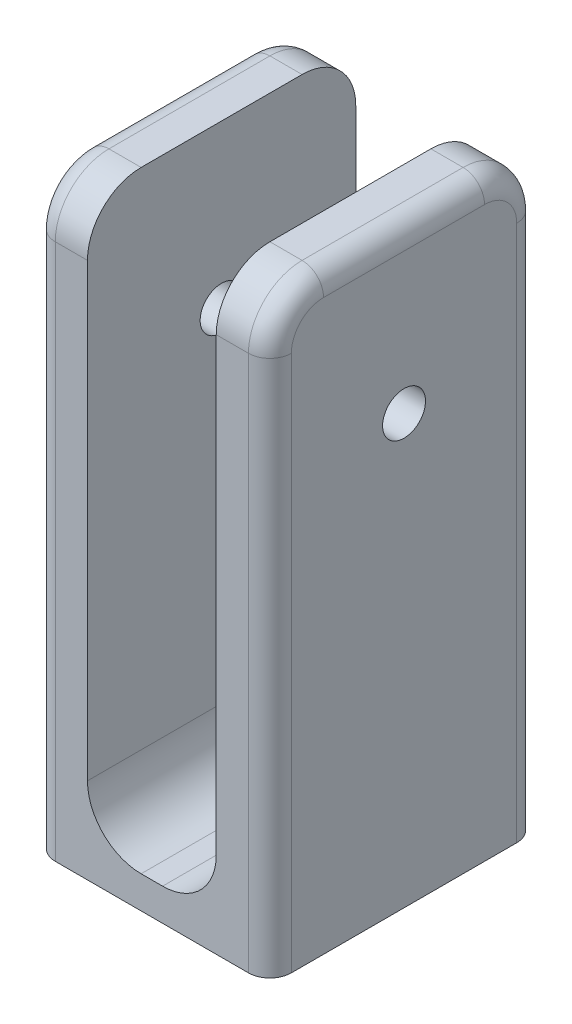
ISO-10303-21;
HEADER;
FILE_DESCRIPTION(('STEP AP214'),'2;1');
FILE_NAME('part.step','',(''),(''),'','','');
FILE_SCHEMA(('AUTOMOTIVE_DESIGN { 1 0 10303 214 1 1 1 1 }'));
ENDSEC;
DATA;
#1=APPLICATION_CONTEXT('core data for automotive mechanical design processes');
#2=APPLICATION_PROTOCOL_DEFINITION('international standard','automotive_design',2000,#1);
#3=PRODUCT_CONTEXT('',#1,'mechanical');
#4=PRODUCT('Part','Part','',(#3));
#5=PRODUCT_RELATED_PRODUCT_CATEGORY('part','',(#4));
#6=PRODUCT_DEFINITION_FORMATION('','',#4);
#7=PRODUCT_DEFINITION_CONTEXT('part definition',#1,'design');
#8=PRODUCT_DEFINITION('design','',#6,#7);
#9=PRODUCT_DEFINITION_SHAPE('','',#8);
#10=(LENGTH_UNIT() NAMED_UNIT(*) SI_UNIT(.MILLI.,.METRE.));
#11=(NAMED_UNIT(*) PLANE_ANGLE_UNIT() SI_UNIT($,.RADIAN.));
#12=(NAMED_UNIT(*) SI_UNIT($,.STERADIAN.) SOLID_ANGLE_UNIT());
#13=UNCERTAINTY_MEASURE_WITH_UNIT(LENGTH_MEASURE(1.E-05),#10,'distance_accuracy_value','');
#14=(GEOMETRIC_REPRESENTATION_CONTEXT(3) GLOBAL_UNCERTAINTY_ASSIGNED_CONTEXT((#13)) GLOBAL_UNIT_ASSIGNED_CONTEXT((#10,
#11,#12)) REPRESENTATION_CONTEXT('',''));
#15=CARTESIAN_POINT('',(0.,0.,0.));
#16=DIRECTION('',(0.,0.,1.));
#17=DIRECTION('',(1.,0.,0.));
#18=AXIS2_PLACEMENT_3D('',#15,#16,#17);
#19=CARTESIAN_POINT('',(0.,3.,-12.5));
#20=DIRECTION('',(0.,0.,1.));
#21=DIRECTION('',(1.,0.,0.));
#22=AXIS2_PLACEMENT_3D('',#19,#20,#21);
#23=PLANE('',#22);
#24=DIRECTION('',(-1.,0.,0.));
#25=VECTOR('',#24,1.);
#26=CARTESIAN_POINT('',(0.,0.,-12.5));
#27=LINE('',#26,#25);
#28=CARTESIAN_POINT('',(9.,0.,-12.5));
#29=VERTEX_POINT('',#28);
#30=CARTESIAN_POINT('',(-9.,0.,-12.5));
#31=VERTEX_POINT('',#30);
#32=EDGE_CURVE('E226',#29,#31,#27,.T.);
#33=ORIENTED_EDGE('',*,*,#32,.T.);
#34=DIRECTION('',(0.,-1.,0.));
#35=VECTOR('',#34,1.);
#36=CARTESIAN_POINT('',(-9.,3.,-12.5));
#37=LINE('',#36,#35);
#38=CARTESIAN_POINT('',(-9.,50.,-12.5));
#39=VERTEX_POINT('',#38);
#40=EDGE_CURVE('E295',#31,#39,#37,.F.);
#41=ORIENTED_EDGE('',*,*,#40,.T.);
#42=DIRECTION('',(-1.,0.,0.));
#43=VECTOR('',#42,1.);
#44=CARTESIAN_POINT('',(-6.,50.,-12.5));
#45=LINE('',#44,#43);
#46=CARTESIAN_POINT('',(-6.,50.,-12.5));
#47=VERTEX_POINT('',#46);
#48=EDGE_CURVE('E194',#39,#47,#45,.F.);
#49=ORIENTED_EDGE('',*,*,#48,.T.);
#50=DIRECTION('',(0.,-1.,0.));
#51=VECTOR('',#50,1.);
#52=CARTESIAN_POINT('',(-6.,55.,-12.5));
#53=LINE('',#52,#51);
#54=CARTESIAN_POINT('',(-6.,8.,-12.5));
#55=VERTEX_POINT('',#54);
#56=EDGE_CURVE('E223',#47,#55,#53,.T.);
#57=ORIENTED_EDGE('',*,*,#56,.T.);
#58=CARTESIAN_POINT('',(-1.,8.,-12.5));
#59=DIRECTION('',(0.,0.,1.));
#60=DIRECTION('',(1.,0.,0.));
#61=AXIS2_PLACEMENT_3D('',#58,#59,#60);
#62=CIRCLE('',#61,5.);
#63=CARTESIAN_POINT('',(-1.,3.,-12.5));
#64=VERTEX_POINT('',#63);
#65=EDGE_CURVE('E271',#55,#64,#62,.T.);
#66=ORIENTED_EDGE('',*,*,#65,.T.);
#67=DIRECTION('',(-1.,0.,0.));
#68=VECTOR('',#67,1.);
#69=CARTESIAN_POINT('',(0.,3.,-12.5));
#70=LINE('',#69,#68);
#71=CARTESIAN_POINT('',(0.999999999999997,3.,-12.5));
#72=VERTEX_POINT('',#71);
#73=EDGE_CURVE('E227',#72,#64,#70,.T.);
#74=ORIENTED_EDGE('',*,*,#73,.F.);
#75=CARTESIAN_POINT('',(0.999999999999997,8.,-12.5));
#76=DIRECTION('',(0.,0.,1.));
#77=DIRECTION('',(1.,0.,0.));
#78=AXIS2_PLACEMENT_3D('',#75,#76,#77);
#79=CIRCLE('',#78,5.);
#80=CARTESIAN_POINT('',(6.,8.,-12.5));
#81=VERTEX_POINT('',#80);
#82=EDGE_CURVE('E267',#72,#81,#79,.T.);
#83=ORIENTED_EDGE('',*,*,#82,.T.);
#84=DIRECTION('',(0.,-1.,0.));
#85=VECTOR('',#84,1.);
#86=CARTESIAN_POINT('',(6.,55.,-12.5));
#87=LINE('',#86,#85);
#88=CARTESIAN_POINT('',(6.,50.,-12.5));
#89=VERTEX_POINT('',#88);
#90=EDGE_CURVE('E204',#89,#81,#87,.T.);
#91=ORIENTED_EDGE('',*,*,#90,.F.);
#92=DIRECTION('',(-1.,0.,0.));
#93=VECTOR('',#92,1.);
#94=CARTESIAN_POINT('',(11.,50.,-12.5));
#95=LINE('',#94,#93);
#96=CARTESIAN_POINT('',(9.,50.,-12.5));
#97=VERTEX_POINT('',#96);
#98=EDGE_CURVE('E190',#89,#97,#95,.F.);
#99=ORIENTED_EDGE('',*,*,#98,.T.);
#100=DIRECTION('',(0.,-1.,0.));
#101=VECTOR('',#100,1.);
#102=CARTESIAN_POINT('',(9.,0.,-12.5));
#103=LINE('',#102,#101);
#104=EDGE_CURVE('E292',#97,#29,#103,.T.);
#105=ORIENTED_EDGE('',*,*,#104,.T.);
#106=EDGE_LOOP('',(#33,#41,#49,#57,#66,#74,#83,#91,#99,#105));
#107=FACE_BOUND('',#106,.T.);
#108=ADVANCED_FACE('F35',(#107),#23,.F.);
#109=CARTESIAN_POINT('',(0.,3.,12.5));
#110=DIRECTION('',(0.,0.,1.));
#111=DIRECTION('',(1.,0.,0.));
#112=AXIS2_PLACEMENT_3D('',#109,#110,#111);
#113=PLANE('',#112);
#114=DIRECTION('',(-1.,0.,0.));
#115=VECTOR('',#114,1.);
#116=CARTESIAN_POINT('',(0.,50.,12.5));
#117=LINE('',#116,#115);
#118=CARTESIAN_POINT('',(-6.,50.,12.5));
#119=VERTEX_POINT('',#118);
#120=CARTESIAN_POINT('',(-9.,50.,12.5));
#121=VERTEX_POINT('',#120);
#122=EDGE_CURVE('E257',#119,#121,#117,.T.);
#123=ORIENTED_EDGE('',*,*,#122,.T.);
#124=DIRECTION('',(0.,-1.,0.));
#125=VECTOR('',#124,1.);
#126=CARTESIAN_POINT('',(-9.,0.,12.5));
#127=LINE('',#126,#125);
#128=CARTESIAN_POINT('',(-9.,0.,12.5));
#129=VERTEX_POINT('',#128);
#130=EDGE_CURVE('E11',#121,#129,#127,.T.);
#131=ORIENTED_EDGE('',*,*,#130,.T.);
#132=DIRECTION('',(-1.,0.,0.));
#133=VECTOR('',#132,1.);
#134=CARTESIAN_POINT('',(0.,0.,12.5));
#135=LINE('',#134,#133);
#136=CARTESIAN_POINT('',(9.00000000000001,0.,12.5));
#137=VERTEX_POINT('',#136);
#138=EDGE_CURVE('E231',#137,#129,#135,.T.);
#139=ORIENTED_EDGE('',*,*,#138,.F.);
#140=DIRECTION('',(0.,-1.,0.));
#141=VECTOR('',#140,1.);
#142=CARTESIAN_POINT('',(9.00000000000001,3.,12.5));
#143=LINE('',#142,#141);
#144=CARTESIAN_POINT('',(9.00000000000001,50.,12.5));
#145=VERTEX_POINT('',#144);
#146=EDGE_CURVE('E44',#137,#145,#143,.F.);
#147=ORIENTED_EDGE('',*,*,#146,.T.);
#148=DIRECTION('',(-1.,0.,0.));
#149=VECTOR('',#148,1.);
#150=CARTESIAN_POINT('',(0.,50.,12.5));
#151=LINE('',#150,#149);
#152=CARTESIAN_POINT('',(6.,50.,12.5));
#153=VERTEX_POINT('',#152);
#154=EDGE_CURVE('E255',#145,#153,#151,.T.);
#155=ORIENTED_EDGE('',*,*,#154,.T.);
#156=DIRECTION('',(0.,-1.,0.));
#157=VECTOR('',#156,1.);
#158=CARTESIAN_POINT('',(6.,55.,12.5));
#159=LINE('',#158,#157);
#160=CARTESIAN_POINT('',(6.,8.,12.5));
#161=VERTEX_POINT('',#160);
#162=EDGE_CURVE('E200',#153,#161,#159,.T.);
#163=ORIENTED_EDGE('',*,*,#162,.T.);
#164=CARTESIAN_POINT('',(1.,8.,12.5));
#165=DIRECTION('',(0.,0.,1.));
#166=DIRECTION('',(1.,0.,0.));
#167=AXIS2_PLACEMENT_3D('',#164,#165,#166);
#168=CIRCLE('',#167,5.);
#169=CARTESIAN_POINT('',(1.,3.,12.5));
#170=VERTEX_POINT('',#169);
#171=EDGE_CURVE('E265',#161,#170,#168,.F.);
#172=ORIENTED_EDGE('',*,*,#171,.T.);
#173=DIRECTION('',(-1.,0.,0.));
#174=VECTOR('',#173,1.);
#175=CARTESIAN_POINT('',(0.,3.,12.5));
#176=LINE('',#175,#174);
#177=CARTESIAN_POINT('',(-0.999999999999997,3.,12.5));
#178=VERTEX_POINT('',#177);
#179=EDGE_CURVE('E230',#170,#178,#176,.T.);
#180=ORIENTED_EDGE('',*,*,#179,.T.);
#181=CARTESIAN_POINT('',(-0.999999999999997,8.,12.5));
#182=DIRECTION('',(0.,0.,1.));
#183=DIRECTION('',(1.,0.,0.));
#184=AXIS2_PLACEMENT_3D('',#181,#182,#183);
#185=CIRCLE('',#184,5.);
#186=CARTESIAN_POINT('',(-6.,8.,12.5));
#187=VERTEX_POINT('',#186);
#188=EDGE_CURVE('E269',#178,#187,#185,.F.);
#189=ORIENTED_EDGE('',*,*,#188,.T.);
#190=DIRECTION('',(0.,-1.,0.));
#191=VECTOR('',#190,1.);
#192=CARTESIAN_POINT('',(-6.,55.,12.5));
#193=LINE('',#192,#191);
#194=EDGE_CURVE('E218',#119,#187,#193,.T.);
#195=ORIENTED_EDGE('',*,*,#194,.F.);
#196=EDGE_LOOP('',(#123,#131,#139,#147,#155,#163,#172,#180,#189,#195));
#197=FACE_BOUND('',#196,.T.);
#198=ADVANCED_FACE('F374',(#197),#113,.T.);
#199=CARTESIAN_POINT('',(0.,3.,0.));
#200=DIRECTION('',(0.,1.,0.));
#201=DIRECTION('',(0.,0.,1.));
#202=AXIS2_PLACEMENT_3D('',#199,#200,#201);
#203=PLANE('',#202);
#204=ORIENTED_EDGE('',*,*,#179,.F.);
#205=DIRECTION('',(0.,0.,1.));
#206=VECTOR('',#205,1.);
#207=CARTESIAN_POINT('',(0.999999999999999,3.,0.));
#208=LINE('',#207,#206);
#209=EDGE_CURVE('E263',#170,#72,#208,.F.);
#210=ORIENTED_EDGE('',*,*,#209,.T.);
#211=ORIENTED_EDGE('',*,*,#73,.T.);
#212=DIRECTION('',(0.,0.,1.));
#213=VECTOR('',#212,1.);
#214=CARTESIAN_POINT('',(-0.999999999999997,3.,12.5));
#215=LINE('',#214,#213);
#216=EDGE_CURVE('E260',#64,#178,#215,.T.);
#217=ORIENTED_EDGE('',*,*,#216,.T.);
#218=EDGE_LOOP('',(#204,#210,#211,#217));
#219=FACE_BOUND('',#218,.T.);
#220=ADVANCED_FACE('F379',(#219),#203,.T.);
#221=CARTESIAN_POINT('',(0.,0.,0.));
#222=DIRECTION('',(0.,1.,0.));
#223=DIRECTION('',(0.,0.,1.));
#224=AXIS2_PLACEMENT_3D('',#221,#222,#223);
#225=PLANE('',#224);
#226=DIRECTION('',(0.,0.,1.));
#227=VECTOR('',#226,1.);
#228=CARTESIAN_POINT('',(-11.,0.,0.));
#229=LINE('',#228,#227);
#230=CARTESIAN_POINT('',(-11.,0.,-10.5));
#231=VERTEX_POINT('',#230);
#232=CARTESIAN_POINT('',(-11.,0.,10.5));
#233=VERTEX_POINT('',#232);
#234=EDGE_CURVE('E214',#231,#233,#229,.T.);
#235=ORIENTED_EDGE('',*,*,#234,.F.);
#236=CARTESIAN_POINT('',(-9.,0.,-10.5));
#237=DIRECTION('',(0.,1.,0.));
#238=DIRECTION('',(0.,0.,1.));
#239=AXIS2_PLACEMENT_3D('',#236,#237,#238);
#240=CIRCLE('',#239,2.);
#241=EDGE_CURVE('E290',#231,#31,#240,.F.);
#242=ORIENTED_EDGE('',*,*,#241,.T.);
#243=ORIENTED_EDGE('',*,*,#32,.F.);
#244=CARTESIAN_POINT('',(9.,0.,-10.5));
#245=DIRECTION('',(0.,1.,0.));
#246=DIRECTION('',(0.,0.,1.));
#247=AXIS2_PLACEMENT_3D('',#244,#245,#246);
#248=CIRCLE('',#247,2.);
#249=CARTESIAN_POINT('',(11.,0.,-10.5));
#250=VERTEX_POINT('',#249);
#251=EDGE_CURVE('E288',#29,#250,#248,.F.);
#252=ORIENTED_EDGE('',*,*,#251,.T.);
#253=DIRECTION('',(0.,0.,1.));
#254=VECTOR('',#253,1.);
#255=CARTESIAN_POINT('',(11.,0.,0.));
#256=LINE('',#255,#254);
#257=CARTESIAN_POINT('',(11.,0.,10.5));
#258=VERTEX_POINT('',#257);
#259=EDGE_CURVE('E201',#250,#258,#256,.T.);
#260=ORIENTED_EDGE('',*,*,#259,.T.);
#261=CARTESIAN_POINT('',(9.00000000000001,0.,10.5));
#262=DIRECTION('',(0.,1.,0.));
#263=DIRECTION('',(0.,0.,1.));
#264=AXIS2_PLACEMENT_3D('',#261,#262,#263);
#265=CIRCLE('',#264,2.);
#266=EDGE_CURVE('E284',#258,#137,#265,.F.);
#267=ORIENTED_EDGE('',*,*,#266,.T.);
#268=ORIENTED_EDGE('',*,*,#138,.T.);
#269=CARTESIAN_POINT('',(-9.,0.,10.5));
#270=DIRECTION('',(0.,1.,0.));
#271=DIRECTION('',(0.,0.,1.));
#272=AXIS2_PLACEMENT_3D('',#269,#270,#271);
#273=CIRCLE('',#272,2.);
#274=EDGE_CURVE('E286',#129,#233,#273,.F.);
#275=ORIENTED_EDGE('',*,*,#274,.T.);
#276=EDGE_LOOP('',(#235,#242,#243,#252,#260,#267,#268,#275));
#277=FACE_BOUND('',#276,.T.);
#278=ADVANCED_FACE('F353',(#277),#225,.F.);
#279=CARTESIAN_POINT('',(-6.,55.,0.));
#280=DIRECTION('',(1.,0.,0.));
#281=DIRECTION('',(0.,0.,-1.));
#282=AXIS2_PLACEMENT_3D('',#279,#280,#281);
#283=PLANE('',#282);
#284=CARTESIAN_POINT('',(-6.,39.9011310873557,0.));
#285=DIRECTION('',(1.,0.,0.));
#286=DIRECTION('',(0.,0.,-1.));
#287=AXIS2_PLACEMENT_3D('',#284,#285,#286);
#288=CIRCLE('',#287,1.99999999999999);
#289=CARTESIAN_POINT('',(-6.,39.9011310873557,-1.99999999999999));
#290=VERTEX_POINT('',#289);
#291=EDGE_CURVE('E702',#290,#290,#288,.T.);
#292=ORIENTED_EDGE('',*,*,#291,.F.);
#293=EDGE_LOOP('',(#292));
#294=FACE_BOUND('',#293,.T.);
#295=ORIENTED_EDGE('',*,*,#56,.F.);
#296=CARTESIAN_POINT('',(-6.,50.,-7.5));
#297=DIRECTION('',(1.,0.,0.));
#298=DIRECTION('',(0.,0.,-1.));
#299=AXIS2_PLACEMENT_3D('',#296,#297,#298);
#300=CIRCLE('',#299,5.);
#301=CARTESIAN_POINT('',(-6.,55.,-7.5));
#302=VERTEX_POINT('',#301);
#303=EDGE_CURVE('E253',#47,#302,#300,.T.);
#304=ORIENTED_EDGE('',*,*,#303,.T.);
#305=DIRECTION('',(0.,0.,1.));
#306=VECTOR('',#305,1.);
#307=CARTESIAN_POINT('',(-6.,55.,0.));
#308=LINE('',#307,#306);
#309=CARTESIAN_POINT('',(-6.,55.,7.5));
#310=VERTEX_POINT('',#309);
#311=EDGE_CURVE('E215',#302,#310,#308,.T.);
#312=ORIENTED_EDGE('',*,*,#311,.T.);
#313=CARTESIAN_POINT('',(-6.,50.,7.5));
#314=DIRECTION('',(1.,0.,0.));
#315=DIRECTION('',(0.,0.,-1.));
#316=AXIS2_PLACEMENT_3D('',#313,#314,#315);
#317=CIRCLE('',#316,5.);
#318=EDGE_CURVE('E251',#310,#119,#317,.T.);
#319=ORIENTED_EDGE('',*,*,#318,.T.);
#320=ORIENTED_EDGE('',*,*,#194,.T.);
#321=DIRECTION('',(0.,0.,1.));
#322=VECTOR('',#321,1.);
#323=CARTESIAN_POINT('',(-6.,8.,-12.5));
#324=LINE('',#323,#322);
#325=EDGE_CURVE('E249',#187,#55,#324,.F.);
#326=ORIENTED_EDGE('',*,*,#325,.T.);
#327=EDGE_LOOP('',(#295,#304,#312,#319,#320,#326));
#328=FACE_BOUND('',#327,.T.);
#329=ADVANCED_FACE('F454',(#294,#328),#283,.T.);
#330=CARTESIAN_POINT('',(-11.,55.,0.));
#331=DIRECTION('',(1.,0.,0.));
#332=DIRECTION('',(0.,0.,-1.));
#333=AXIS2_PLACEMENT_3D('',#330,#331,#332);
#334=PLANE('',#333);
#335=CARTESIAN_POINT('',(-11.,39.9011310873557,0.));
#336=DIRECTION('',(-1.,0.,0.));
#337=DIRECTION('',(0.,0.,1.));
#338=AXIS2_PLACEMENT_3D('',#335,#336,#337);
#339=CIRCLE('',#338,1.99999999999999);
#340=CARTESIAN_POINT('',(-11.,39.9011310873557,1.99999999999999));
#341=VERTEX_POINT('',#340);
#342=EDGE_CURVE('E706',#341,#341,#339,.T.);
#343=ORIENTED_EDGE('',*,*,#342,.F.);
#344=EDGE_LOOP('',(#343));
#345=FACE_BOUND('',#344,.T.);
#346=CARTESIAN_POINT('',(-11.,50.,-7.5));
#347=DIRECTION('',(1.,0.,0.));
#348=DIRECTION('',(0.,0.,-1.));
#349=AXIS2_PLACEMENT_3D('',#346,#347,#348);
#350=CIRCLE('',#349,3.);
#351=CARTESIAN_POINT('',(-11.,53.,-7.5));
#352=VERTEX_POINT('',#351);
#353=CARTESIAN_POINT('',(-11.,50.,-10.5));
#354=VERTEX_POINT('',#353);
#355=EDGE_CURVE('E279',#352,#354,#350,.F.);
#356=ORIENTED_EDGE('',*,*,#355,.T.);
#357=DIRECTION('',(0.,-1.,0.));
#358=VECTOR('',#357,1.);
#359=CARTESIAN_POINT('',(-11.,55.,-10.5));
#360=LINE('',#359,#358);
#361=EDGE_CURVE('E281',#354,#231,#360,.T.);
#362=ORIENTED_EDGE('',*,*,#361,.T.);
#363=ORIENTED_EDGE('',*,*,#234,.T.);
#364=DIRECTION('',(0.,-1.,0.));
#365=VECTOR('',#364,1.);
#366=CARTESIAN_POINT('',(-11.,50.,10.5));
#367=LINE('',#366,#365);
#368=CARTESIAN_POINT('',(-11.,50.,10.5));
#369=VERTEX_POINT('',#368);
#370=EDGE_CURVE('E273',#233,#369,#367,.F.);
#371=ORIENTED_EDGE('',*,*,#370,.T.);
#372=CARTESIAN_POINT('',(-11.,50.,7.5));
#373=DIRECTION('',(1.,0.,0.));
#374=DIRECTION('',(0.,0.,-1.));
#375=AXIS2_PLACEMENT_3D('',#372,#373,#374);
#376=CIRCLE('',#375,3.);
#377=CARTESIAN_POINT('',(-11.,53.,7.5));
#378=VERTEX_POINT('',#377);
#379=EDGE_CURVE('E275',#369,#378,#376,.F.);
#380=ORIENTED_EDGE('',*,*,#379,.T.);
#381=DIRECTION('',(0.,0.,1.));
#382=VECTOR('',#381,1.);
#383=CARTESIAN_POINT('',(-11.,53.,-7.5));
#384=LINE('',#383,#382);
#385=EDGE_CURVE('E277',#378,#352,#384,.F.);
#386=ORIENTED_EDGE('',*,*,#385,.T.);
#387=EDGE_LOOP('',(#356,#362,#363,#371,#380,#386));
#388=FACE_BOUND('',#387,.T.);
#389=ADVANCED_FACE('F450',(#345,#388),#334,.F.);
#390=CARTESIAN_POINT('',(0.,55.,0.));
#391=DIRECTION('',(0.,1.,0.));
#392=DIRECTION('',(0.,0.,1.));
#393=AXIS2_PLACEMENT_3D('',#390,#391,#392);
#394=PLANE('',#393);
#395=DIRECTION('',(-1.,0.,0.));
#396=VECTOR('',#395,1.);
#397=CARTESIAN_POINT('',(-11.,55.,-7.5));
#398=LINE('',#397,#396);
#399=CARTESIAN_POINT('',(-9.,55.,-7.5));
#400=VERTEX_POINT('',#399);
#401=EDGE_CURVE('E246',#302,#400,#398,.T.);
#402=ORIENTED_EDGE('',*,*,#401,.T.);
#403=DIRECTION('',(0.,0.,1.));
#404=VECTOR('',#403,1.);
#405=CARTESIAN_POINT('',(-9.,55.,7.5));
#406=LINE('',#405,#404);
#407=CARTESIAN_POINT('',(-9.,55.,7.5));
#408=VERTEX_POINT('',#407);
#409=EDGE_CURVE('E299',#400,#408,#406,.T.);
#410=ORIENTED_EDGE('',*,*,#409,.T.);
#411=DIRECTION('',(-1.,0.,0.));
#412=VECTOR('',#411,1.);
#413=CARTESIAN_POINT('',(0.,55.,7.5));
#414=LINE('',#413,#412);
#415=EDGE_CURVE('E244',#408,#310,#414,.F.);
#416=ORIENTED_EDGE('',*,*,#415,.T.);
#417=ORIENTED_EDGE('',*,*,#311,.F.);
#418=EDGE_LOOP('',(#402,#410,#416,#417));
#419=FACE_BOUND('',#418,.T.);
#420=ADVANCED_FACE('F446',(#419),#394,.T.);
#421=CARTESIAN_POINT('',(6.,55.,0.));
#422=DIRECTION('',(1.,0.,0.));
#423=DIRECTION('',(0.,0.,-1.));
#424=AXIS2_PLACEMENT_3D('',#421,#422,#423);
#425=PLANE('',#424);
#426=CARTESIAN_POINT('',(6.,39.9011310873557,0.));
#427=DIRECTION('',(1.,0.,0.));
#428=DIRECTION('',(0.,0.,-1.));
#429=AXIS2_PLACEMENT_3D('',#426,#427,#428);
#430=CIRCLE('',#429,1.99999999999999);
#431=CARTESIAN_POINT('',(6.,39.9011310873557,-1.99999999999999));
#432=VERTEX_POINT('',#431);
#433=EDGE_CURVE('E210',#432,#432,#430,.T.);
#434=ORIENTED_EDGE('',*,*,#433,.T.);
#435=EDGE_LOOP('',(#434));
#436=FACE_BOUND('',#435,.T.);
#437=DIRECTION('',(0.,0.,1.));
#438=VECTOR('',#437,1.);
#439=CARTESIAN_POINT('',(6.,55.,0.));
#440=LINE('',#439,#438);
#441=CARTESIAN_POINT('',(6.,55.,-7.5));
#442=VERTEX_POINT('',#441);
#443=CARTESIAN_POINT('',(6.,55.,7.5));
#444=VERTEX_POINT('',#443);
#445=EDGE_CURVE('E178',#442,#444,#440,.T.);
#446=ORIENTED_EDGE('',*,*,#445,.F.);
#447=CARTESIAN_POINT('',(6.,50.,-7.5));
#448=DIRECTION('',(1.,0.,0.));
#449=DIRECTION('',(0.,0.,-1.));
#450=AXIS2_PLACEMENT_3D('',#447,#448,#449);
#451=CIRCLE('',#450,5.);
#452=EDGE_CURVE('E187',#442,#89,#451,.F.);
#453=ORIENTED_EDGE('',*,*,#452,.T.);
#454=ORIENTED_EDGE('',*,*,#90,.T.);
#455=DIRECTION('',(0.,0.,1.));
#456=VECTOR('',#455,1.);
#457=CARTESIAN_POINT('',(6.,8.,0.));
#458=LINE('',#457,#456);
#459=EDGE_CURVE('E183',#81,#161,#458,.T.);
#460=ORIENTED_EDGE('',*,*,#459,.T.);
#461=ORIENTED_EDGE('',*,*,#162,.F.);
#462=CARTESIAN_POINT('',(6.,50.,7.5));
#463=DIRECTION('',(1.,0.,0.));
#464=DIRECTION('',(0.,0.,-1.));
#465=AXIS2_PLACEMENT_3D('',#462,#463,#464);
#466=CIRCLE('',#465,5.);
#467=EDGE_CURVE('E195',#153,#444,#466,.F.);
#468=ORIENTED_EDGE('',*,*,#467,.T.);
#469=EDGE_LOOP('',(#446,#453,#454,#460,#461,#468));
#470=FACE_BOUND('',#469,.T.);
#471=ADVANCED_FACE('F197',(#436,#470),#425,.F.);
#472=CARTESIAN_POINT('',(11.,55.,0.));
#473=DIRECTION('',(1.,0.,0.));
#474=DIRECTION('',(0.,0.,-1.));
#475=AXIS2_PLACEMENT_3D('',#472,#473,#474);
#476=PLANE('',#475);
#477=CARTESIAN_POINT('',(11.,39.9011310873557,0.));
#478=DIRECTION('',(-1.,0.,0.));
#479=DIRECTION('',(0.,0.,1.));
#480=AXIS2_PLACEMENT_3D('',#477,#478,#479);
#481=CIRCLE('',#480,1.99999999999999);
#482=CARTESIAN_POINT('',(11.,39.9011310873557,1.99999999999999));
#483=VERTEX_POINT('',#482);
#484=EDGE_CURVE('E703',#483,#483,#481,.T.);
#485=ORIENTED_EDGE('',*,*,#484,.T.);
#486=EDGE_LOOP('',(#485));
#487=FACE_BOUND('',#486,.T.);
#488=ORIENTED_EDGE('',*,*,#259,.F.);
#489=DIRECTION('',(0.,-1.,0.));
#490=VECTOR('',#489,1.);
#491=CARTESIAN_POINT('',(11.,50.,-10.5));
#492=LINE('',#491,#490);
#493=CARTESIAN_POINT('',(11.,50.,-10.5));
#494=VERTEX_POINT('',#493);
#495=EDGE_CURVE('E311',#250,#494,#492,.F.);
#496=ORIENTED_EDGE('',*,*,#495,.T.);
#497=CARTESIAN_POINT('',(11.,50.,-7.5));
#498=DIRECTION('',(1.,0.,0.));
#499=DIRECTION('',(0.,0.,-1.));
#500=AXIS2_PLACEMENT_3D('',#497,#498,#499);
#501=CIRCLE('',#500,3.);
#502=CARTESIAN_POINT('',(11.,53.,-7.5));
#503=VERTEX_POINT('',#502);
#504=EDGE_CURVE('E309',#494,#503,#501,.T.);
#505=ORIENTED_EDGE('',*,*,#504,.T.);
#506=DIRECTION('',(0.,0.,1.));
#507=VECTOR('',#506,1.);
#508=CARTESIAN_POINT('',(11.,53.,0.));
#509=LINE('',#508,#507);
#510=CARTESIAN_POINT('',(11.,53.,7.5));
#511=VERTEX_POINT('',#510);
#512=EDGE_CURVE('E307',#503,#511,#509,.T.);
#513=ORIENTED_EDGE('',*,*,#512,.T.);
#514=CARTESIAN_POINT('',(11.,50.,7.5));
#515=DIRECTION('',(1.,0.,0.));
#516=DIRECTION('',(0.,0.,-1.));
#517=AXIS2_PLACEMENT_3D('',#514,#515,#516);
#518=CIRCLE('',#517,3.);
#519=CARTESIAN_POINT('',(11.,50.,10.5));
#520=VERTEX_POINT('',#519);
#521=EDGE_CURVE('E305',#511,#520,#518,.T.);
#522=ORIENTED_EDGE('',*,*,#521,.T.);
#523=DIRECTION('',(0.,-1.,0.));
#524=VECTOR('',#523,1.);
#525=CARTESIAN_POINT('',(11.,55.,10.5));
#526=LINE('',#525,#524);
#527=EDGE_CURVE('E303',#520,#258,#526,.T.);
#528=ORIENTED_EDGE('',*,*,#527,.T.);
#529=EDGE_LOOP('',(#488,#496,#505,#513,#522,#528));
#530=FACE_BOUND('',#529,.T.);
#531=ADVANCED_FACE('F349',(#487,#530),#476,.T.);
#532=CARTESIAN_POINT('',(0.,55.,0.));
#533=DIRECTION('',(0.,1.,0.));
#534=DIRECTION('',(0.,0.,1.));
#535=AXIS2_PLACEMENT_3D('',#532,#533,#534);
#536=PLANE('',#535);
#537=DIRECTION('',(-1.,0.,0.));
#538=VECTOR('',#537,1.);
#539=CARTESIAN_POINT('',(0.,55.,7.5));
#540=LINE('',#539,#538);
#541=CARTESIAN_POINT('',(9.00000000000001,55.,7.5));
#542=VERTEX_POINT('',#541);
#543=EDGE_CURVE('E184',#444,#542,#540,.F.);
#544=ORIENTED_EDGE('',*,*,#543,.T.);
#545=DIRECTION('',(0.,0.,1.));
#546=VECTOR('',#545,1.);
#547=CARTESIAN_POINT('',(9.,55.,0.));
#548=LINE('',#547,#546);
#549=CARTESIAN_POINT('',(9.,55.,-7.5));
#550=VERTEX_POINT('',#549);
#551=EDGE_CURVE('E180',#542,#550,#548,.F.);
#552=ORIENTED_EDGE('',*,*,#551,.T.);
#553=DIRECTION('',(-1.,0.,0.));
#554=VECTOR('',#553,1.);
#555=CARTESIAN_POINT('',(6.,55.,-7.5));
#556=LINE('',#555,#554);
#557=EDGE_CURVE('E174',#550,#442,#556,.T.);
#558=ORIENTED_EDGE('',*,*,#557,.T.);
#559=ORIENTED_EDGE('',*,*,#445,.T.);
#560=EDGE_LOOP('',(#544,#552,#558,#559));
#561=FACE_BOUND('',#560,.T.);
#562=ADVANCED_FACE('F176',(#561),#536,.T.);
#563=CARTESIAN_POINT('',(0.,50.,-7.5));
#564=DIRECTION('',(1.,0.,0.));
#565=DIRECTION('',(0.,0.,-1.));
#566=AXIS2_PLACEMENT_3D('',#563,#564,#565);
#567=CYLINDRICAL_SURFACE('',#566,5.);
#568=ORIENTED_EDGE('',*,*,#557,.F.);
#569=CARTESIAN_POINT('',(9.,50.,-7.5));
#570=DIRECTION('',(1.,0.,0.));
#571=DIRECTION('',(0.,0.,-1.));
#572=AXIS2_PLACEMENT_3D('',#569,#570,#571);
#573=CIRCLE('',#572,5.);
#574=EDGE_CURVE('E313',#550,#97,#573,.F.);
#575=ORIENTED_EDGE('',*,*,#574,.T.);
#576=ORIENTED_EDGE('',*,*,#98,.F.);
#577=ORIENTED_EDGE('',*,*,#452,.F.);
#578=EDGE_LOOP('',(#568,#575,#576,#577));
#579=FACE_BOUND('',#578,.T.);
#580=ADVANCED_FACE('F188',(#579),#567,.T.);
#581=CARTESIAN_POINT('',(0.,50.,-7.5));
#582=DIRECTION('',(1.,0.,0.));
#583=DIRECTION('',(0.,0.,-1.));
#584=AXIS2_PLACEMENT_3D('',#581,#582,#583);
#585=CYLINDRICAL_SURFACE('',#584,5.);
#586=ORIENTED_EDGE('',*,*,#48,.F.);
#587=CARTESIAN_POINT('',(-9.,50.,-7.5));
#588=DIRECTION('',(1.,0.,0.));
#589=DIRECTION('',(0.,0.,-1.));
#590=AXIS2_PLACEMENT_3D('',#587,#588,#589);
#591=CIRCLE('',#590,5.);
#592=EDGE_CURVE('E297',#39,#400,#591,.T.);
#593=ORIENTED_EDGE('',*,*,#592,.T.);
#594=ORIENTED_EDGE('',*,*,#401,.F.);
#595=ORIENTED_EDGE('',*,*,#303,.F.);
#596=EDGE_LOOP('',(#586,#593,#594,#595));
#597=FACE_BOUND('',#596,.T.);
#598=ADVANCED_FACE('F385',(#597),#585,.T.);
#599=CARTESIAN_POINT('',(0.,50.,7.5));
#600=DIRECTION('',(-1.,0.,0.));
#601=DIRECTION('',(0.,0.,1.));
#602=AXIS2_PLACEMENT_3D('',#599,#600,#601);
#603=CYLINDRICAL_SURFACE('',#602,5.);
#604=ORIENTED_EDGE('',*,*,#415,.F.);
#605=CARTESIAN_POINT('',(-9.,50.,7.5));
#606=DIRECTION('',(1.,0.,0.));
#607=DIRECTION('',(0.,0.,-1.));
#608=AXIS2_PLACEMENT_3D('',#605,#606,#607);
#609=CIRCLE('',#608,5.);
#610=EDGE_CURVE('E301',#408,#121,#609,.T.);
#611=ORIENTED_EDGE('',*,*,#610,.T.);
#612=ORIENTED_EDGE('',*,*,#122,.F.);
#613=ORIENTED_EDGE('',*,*,#318,.F.);
#614=EDGE_LOOP('',(#604,#611,#612,#613));
#615=FACE_BOUND('',#614,.T.);
#616=ADVANCED_FACE('F388',(#615),#603,.T.);
#617=CARTESIAN_POINT('',(0.,50.,7.5));
#618=DIRECTION('',(-1.,0.,0.));
#619=DIRECTION('',(0.,0.,1.));
#620=AXIS2_PLACEMENT_3D('',#617,#618,#619);
#621=CYLINDRICAL_SURFACE('',#620,5.);
#622=ORIENTED_EDGE('',*,*,#154,.F.);
#623=CARTESIAN_POINT('',(9.00000000000001,50.,7.5));
#624=DIRECTION('',(1.,0.,0.));
#625=DIRECTION('',(0.,0.,-1.));
#626=AXIS2_PLACEMENT_3D('',#623,#624,#625);
#627=CIRCLE('',#626,5.);
#628=EDGE_CURVE('E58',#145,#542,#627,.F.);
#629=ORIENTED_EDGE('',*,*,#628,.T.);
#630=ORIENTED_EDGE('',*,*,#543,.F.);
#631=ORIENTED_EDGE('',*,*,#467,.F.);
#632=EDGE_LOOP('',(#622,#629,#630,#631));
#633=FACE_BOUND('',#632,.T.);
#634=ADVANCED_FACE('F392',(#633),#621,.T.);
#635=CARTESIAN_POINT('',(0.999999999999999,8.,0.));
#636=DIRECTION('',(0.,0.,1.));
#637=DIRECTION('',(1.,0.,0.));
#638=AXIS2_PLACEMENT_3D('',#635,#636,#637);
#639=CYLINDRICAL_SURFACE('',#638,5.);
#640=ORIENTED_EDGE('',*,*,#82,.F.);
#641=ORIENTED_EDGE('',*,*,#209,.F.);
#642=ORIENTED_EDGE('',*,*,#171,.F.);
#643=ORIENTED_EDGE('',*,*,#459,.F.);
#644=EDGE_LOOP('',(#640,#641,#642,#643));
#645=FACE_BOUND('',#644,.T.);
#646=ADVANCED_FACE('F396',(#645),#639,.F.);
#647=CARTESIAN_POINT('',(-0.999999999999999,8.,0.));
#648=DIRECTION('',(0.,0.,-1.));
#649=DIRECTION('',(-1.,0.,0.));
#650=AXIS2_PLACEMENT_3D('',#647,#648,#649);
#651=CYLINDRICAL_SURFACE('',#650,5.);
#652=ORIENTED_EDGE('',*,*,#65,.F.);
#653=ORIENTED_EDGE('',*,*,#325,.F.);
#654=ORIENTED_EDGE('',*,*,#188,.F.);
#655=ORIENTED_EDGE('',*,*,#216,.F.);
#656=EDGE_LOOP('',(#652,#653,#654,#655));
#657=FACE_BOUND('',#656,.T.);
#658=ADVANCED_FACE('F399',(#657),#651,.F.);
#659=CARTESIAN_POINT('',(-9.,3.,10.5));
#660=DIRECTION('',(0.,1.,0.));
#661=DIRECTION('',(0.,0.,1.));
#662=AXIS2_PLACEMENT_3D('',#659,#660,#661);
#663=CYLINDRICAL_SURFACE('',#662,2.);
#664=ORIENTED_EDGE('',*,*,#274,.F.);
#665=ORIENTED_EDGE('',*,*,#130,.F.);
#666=CARTESIAN_POINT('',(-9.,50.,10.5));
#667=DIRECTION('',(0.,1.,0.));
#668=DIRECTION('',(0.,0.,1.));
#669=AXIS2_PLACEMENT_3D('',#666,#667,#668);
#670=CIRCLE('',#669,2.);
#671=EDGE_CURVE('E207',#369,#121,#670,.T.);
#672=ORIENTED_EDGE('',*,*,#671,.F.);
#673=ORIENTED_EDGE('',*,*,#370,.F.);
#674=EDGE_LOOP('',(#664,#665,#672,#673));
#675=FACE_BOUND('',#674,.T.);
#676=ADVANCED_FACE('F403',(#675),#663,.T.);
#677=CARTESIAN_POINT('',(-9.,50.,7.5));
#678=DIRECTION('',(1.,0.,0.));
#679=DIRECTION('',(0.,0.,-1.));
#680=AXIS2_PLACEMENT_3D('',#677,#678,#679);
#681=TOROIDAL_SURFACE('',#680,3.,2.);
#682=ORIENTED_EDGE('',*,*,#671,.T.);
#683=ORIENTED_EDGE('',*,*,#610,.F.);
#684=CARTESIAN_POINT('',(-9.,53.,7.5));
#685=DIRECTION('',(0.,0.,-1.));
#686=DIRECTION('',(-1.,0.,0.));
#687=AXIS2_PLACEMENT_3D('',#684,#685,#686);
#688=CIRCLE('',#687,2.);
#689=EDGE_CURVE('E324',#378,#408,#688,.T.);
#690=ORIENTED_EDGE('',*,*,#689,.F.);
#691=ORIENTED_EDGE('',*,*,#379,.F.);
#692=EDGE_LOOP('',(#682,#683,#690,#691));
#693=FACE_BOUND('',#692,.T.);
#694=ADVANCED_FACE('F416',(#693),#681,.T.);
#695=CARTESIAN_POINT('',(-9.,53.,0.));
#696=DIRECTION('',(0.,0.,-1.));
#697=DIRECTION('',(-1.,0.,0.));
#698=AXIS2_PLACEMENT_3D('',#695,#696,#697);
#699=CYLINDRICAL_SURFACE('',#698,2.);
#700=ORIENTED_EDGE('',*,*,#689,.T.);
#701=ORIENTED_EDGE('',*,*,#409,.F.);
#702=CARTESIAN_POINT('',(-9.,53.,-7.5));
#703=DIRECTION('',(0.,0.,-1.));
#704=DIRECTION('',(-1.,0.,0.));
#705=AXIS2_PLACEMENT_3D('',#702,#703,#704);
#706=CIRCLE('',#705,2.);
#707=EDGE_CURVE('E321',#352,#400,#706,.T.);
#708=ORIENTED_EDGE('',*,*,#707,.F.);
#709=ORIENTED_EDGE('',*,*,#385,.F.);
#710=EDGE_LOOP('',(#700,#701,#708,#709));
#711=FACE_BOUND('',#710,.T.);
#712=ADVANCED_FACE('F412',(#711),#699,.T.);
#713=CARTESIAN_POINT('',(-9.,50.,-7.5));
#714=DIRECTION('',(1.,0.,0.));
#715=DIRECTION('',(0.,0.,-1.));
#716=AXIS2_PLACEMENT_3D('',#713,#714,#715);
#717=TOROIDAL_SURFACE('',#716,3.,2.);
#718=ORIENTED_EDGE('',*,*,#707,.T.);
#719=ORIENTED_EDGE('',*,*,#592,.F.);
#720=CARTESIAN_POINT('',(-9.,50.,-10.5));
#721=DIRECTION('',(0.,-1.,0.));
#722=DIRECTION('',(0.,0.,-1.));
#723=AXIS2_PLACEMENT_3D('',#720,#721,#722);
#724=CIRCLE('',#723,2.);
#725=EDGE_CURVE('E318',#354,#39,#724,.T.);
#726=ORIENTED_EDGE('',*,*,#725,.F.);
#727=ORIENTED_EDGE('',*,*,#355,.F.);
#728=EDGE_LOOP('',(#718,#719,#726,#727));
#729=FACE_BOUND('',#728,.T.);
#730=ADVANCED_FACE('F408',(#729),#717,.T.);
#731=CARTESIAN_POINT('',(-9.,55.,-10.5));
#732=DIRECTION('',(0.,-1.,0.));
#733=DIRECTION('',(0.,0.,-1.));
#734=AXIS2_PLACEMENT_3D('',#731,#732,#733);
#735=CYLINDRICAL_SURFACE('',#734,2.);
#736=ORIENTED_EDGE('',*,*,#725,.T.);
#737=ORIENTED_EDGE('',*,*,#40,.F.);
#738=ORIENTED_EDGE('',*,*,#241,.F.);
#739=ORIENTED_EDGE('',*,*,#361,.F.);
#740=EDGE_LOOP('',(#736,#737,#738,#739));
#741=FACE_BOUND('',#740,.T.);
#742=ADVANCED_FACE('F405',(#741),#735,.T.);
#743=CARTESIAN_POINT('',(9.00000000000001,55.,10.5));
#744=DIRECTION('',(0.,-1.,0.));
#745=DIRECTION('',(0.,0.,-1.));
#746=AXIS2_PLACEMENT_3D('',#743,#744,#745);
#747=CYLINDRICAL_SURFACE('',#746,2.);
#748=ORIENTED_EDGE('',*,*,#266,.F.);
#749=ORIENTED_EDGE('',*,*,#527,.F.);
#750=CARTESIAN_POINT('',(9.00000000000001,50.,10.5));
#751=DIRECTION('',(0.,1.,0.));
#752=DIRECTION('',(0.,0.,1.));
#753=AXIS2_PLACEMENT_3D('',#750,#751,#752);
#754=CIRCLE('',#753,2.);
#755=EDGE_CURVE('E39',#145,#520,#754,.T.);
#756=ORIENTED_EDGE('',*,*,#755,.F.);
#757=ORIENTED_EDGE('',*,*,#146,.F.);
#758=EDGE_LOOP('',(#748,#749,#756,#757));
#759=FACE_BOUND('',#758,.T.);
#760=ADVANCED_FACE('F37',(#759),#747,.T.);
#761=CARTESIAN_POINT('',(9.00000000000001,50.,7.5));
#762=DIRECTION('',(1.,0.,0.));
#763=DIRECTION('',(0.,0.,-1.));
#764=AXIS2_PLACEMENT_3D('',#761,#762,#763);
#765=TOROIDAL_SURFACE('',#764,3.,2.);
#766=ORIENTED_EDGE('',*,*,#755,.T.);
#767=ORIENTED_EDGE('',*,*,#521,.F.);
#768=CARTESIAN_POINT('',(9.00000000000001,53.,7.5));
#769=DIRECTION('',(0.,0.,-1.));
#770=DIRECTION('',(-1.,0.,0.));
#771=AXIS2_PLACEMENT_3D('',#768,#769,#770);
#772=CIRCLE('',#771,2.);
#773=EDGE_CURVE('E334',#542,#511,#772,.T.);
#774=ORIENTED_EDGE('',*,*,#773,.F.);
#775=ORIENTED_EDGE('',*,*,#628,.F.);
#776=EDGE_LOOP('',(#766,#767,#774,#775));
#777=FACE_BOUND('',#776,.T.);
#778=ADVANCED_FACE('F343',(#777),#765,.T.);
#779=CARTESIAN_POINT('',(9.,53.,0.));
#780=DIRECTION('',(0.,0.,1.));
#781=DIRECTION('',(1.,0.,0.));
#782=AXIS2_PLACEMENT_3D('',#779,#780,#781);
#783=CYLINDRICAL_SURFACE('',#782,2.);
#784=ORIENTED_EDGE('',*,*,#773,.T.);
#785=ORIENTED_EDGE('',*,*,#512,.F.);
#786=CARTESIAN_POINT('',(9.,53.,-7.5));
#787=DIRECTION('',(0.,0.,-1.));
#788=DIRECTION('',(-1.,0.,0.));
#789=AXIS2_PLACEMENT_3D('',#786,#787,#788);
#790=CIRCLE('',#789,2.);
#791=EDGE_CURVE('E332',#550,#503,#790,.T.);
#792=ORIENTED_EDGE('',*,*,#791,.F.);
#793=ORIENTED_EDGE('',*,*,#551,.F.);
#794=EDGE_LOOP('',(#784,#785,#792,#793));
#795=FACE_BOUND('',#794,.T.);
#796=ADVANCED_FACE('F365',(#795),#783,.T.);
#797=CARTESIAN_POINT('',(9.,50.,-7.5));
#798=DIRECTION('',(1.,0.,0.));
#799=DIRECTION('',(0.,0.,-1.));
#800=AXIS2_PLACEMENT_3D('',#797,#798,#799);
#801=TOROIDAL_SURFACE('',#800,3.,2.);
#802=ORIENTED_EDGE('',*,*,#791,.T.);
#803=ORIENTED_EDGE('',*,*,#504,.F.);
#804=CARTESIAN_POINT('',(9.,50.,-10.5));
#805=DIRECTION('',(0.,-1.,0.));
#806=DIRECTION('',(0.,0.,-1.));
#807=AXIS2_PLACEMENT_3D('',#804,#805,#806);
#808=CIRCLE('',#807,2.);
#809=EDGE_CURVE('E329',#97,#494,#808,.T.);
#810=ORIENTED_EDGE('',*,*,#809,.F.);
#811=ORIENTED_EDGE('',*,*,#574,.F.);
#812=EDGE_LOOP('',(#802,#803,#810,#811));
#813=FACE_BOUND('',#812,.T.);
#814=ADVANCED_FACE('F364',(#813),#801,.T.);
#815=CARTESIAN_POINT('',(9.,3.,-10.5));
#816=DIRECTION('',(0.,1.,0.));
#817=DIRECTION('',(0.,0.,1.));
#818=AXIS2_PLACEMENT_3D('',#815,#816,#817);
#819=CYLINDRICAL_SURFACE('',#818,2.);
#820=ORIENTED_EDGE('',*,*,#809,.T.);
#821=ORIENTED_EDGE('',*,*,#495,.F.);
#822=ORIENTED_EDGE('',*,*,#251,.F.);
#823=ORIENTED_EDGE('',*,*,#104,.F.);
#824=EDGE_LOOP('',(#820,#821,#822,#823));
#825=FACE_BOUND('',#824,.T.);
#826=ADVANCED_FACE('F357',(#825),#819,.T.);
#827=CARTESIAN_POINT('',(-11.,39.9011310873557,0.));
#828=DIRECTION('',(-1.,0.,0.));
#829=DIRECTION('',(0.,0.,1.));
#830=AXIS2_PLACEMENT_3D('',#827,#828,#829);
#831=CYLINDRICAL_SURFACE('',#830,1.99999999999999);
#832=ORIENTED_EDGE('',*,*,#484,.F.);
#833=EDGE_LOOP('',(#832));
#834=FACE_BOUND('',#833,.T.);
#835=ORIENTED_EDGE('',*,*,#433,.F.);
#836=EDGE_LOOP('',(#835));
#837=FACE_BOUND('',#836,.T.);
#838=ADVANCED_FACE('F425',(#834,#837),#831,.F.);
#839=ORIENTED_EDGE('',*,*,#291,.T.);
#840=EDGE_LOOP('',(#839));
#841=FACE_BOUND('',#840,.T.);
#842=ORIENTED_EDGE('',*,*,#342,.T.);
#843=EDGE_LOOP('',(#842));
#844=FACE_BOUND('',#843,.T.);
#845=ADVANCED_FACE('F429',(#841,#844),#831,.F.);
#846=CLOSED_SHELL('',(#108,#198,#220,#278,#329,#389,#420,#471,#531,#562,#580,#598,#616,#634,
#646,#658,#676,#694,#712,#730,#742,#760,#778,#796,#814,#826,#838,#845));
#847=MANIFOLD_SOLID_BREP('B2',#846);
#848=ADVANCED_BREP_SHAPE_REPRESENTATION('',(#18,#847),#14);
#849=SHAPE_DEFINITION_REPRESENTATION(#9,#848);
ENDSEC;
END-ISO-10303-21;
